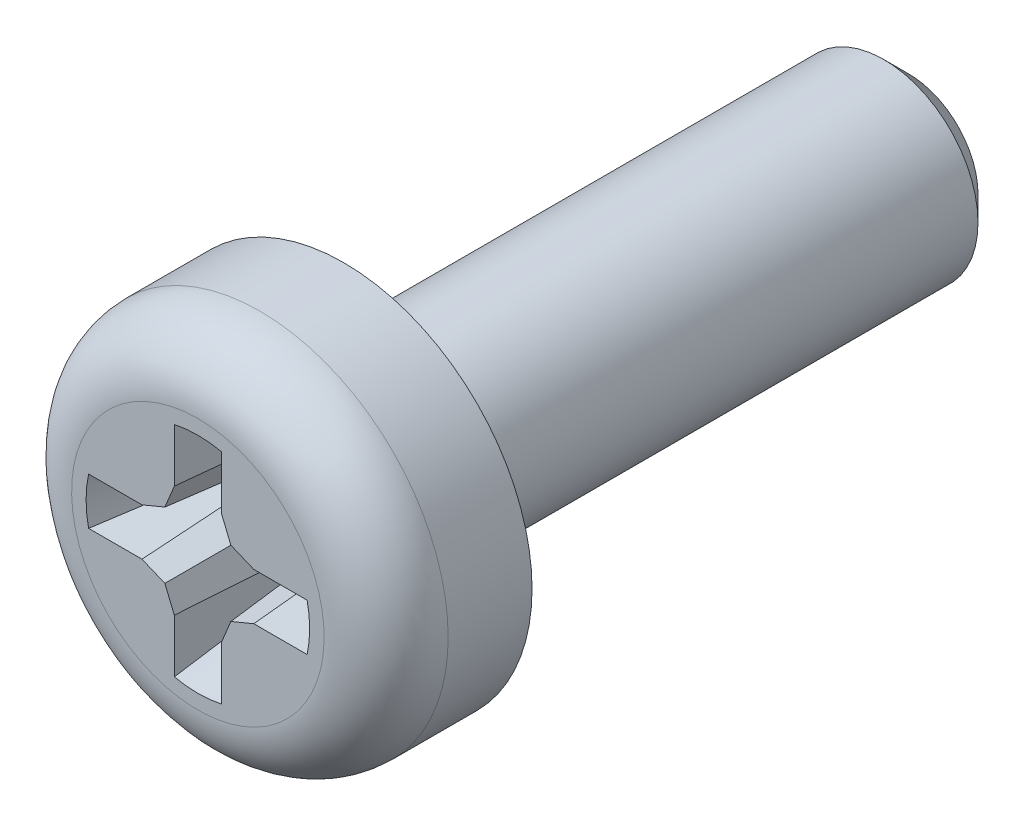
ISO-10303-21;
HEADER;
FILE_DESCRIPTION(('STEP AP214'),'2;1');
FILE_NAME('part.step','',(''),(''),'','','');
FILE_SCHEMA(('AUTOMOTIVE_DESIGN { 1 0 10303 214 1 1 1 1 }'));
ENDSEC;
DATA;
#1=APPLICATION_CONTEXT('core data for automotive mechanical design processes');
#2=APPLICATION_PROTOCOL_DEFINITION('international standard','automotive_design',2000,#1);
#3=PRODUCT_CONTEXT('',#1,'mechanical');
#4=PRODUCT('Part','Part','',(#3));
#5=PRODUCT_RELATED_PRODUCT_CATEGORY('part','',(#4));
#6=PRODUCT_DEFINITION_FORMATION('','',#4);
#7=PRODUCT_DEFINITION_CONTEXT('part definition',#1,'design');
#8=PRODUCT_DEFINITION('design','',#6,#7);
#9=PRODUCT_DEFINITION_SHAPE('','',#8);
#10=(LENGTH_UNIT() NAMED_UNIT(*) SI_UNIT(.MILLI.,.METRE.));
#11=(NAMED_UNIT(*) PLANE_ANGLE_UNIT() SI_UNIT($,.RADIAN.));
#12=(NAMED_UNIT(*) SI_UNIT($,.STERADIAN.) SOLID_ANGLE_UNIT());
#13=UNCERTAINTY_MEASURE_WITH_UNIT(LENGTH_MEASURE(1.E-05),#10,'distance_accuracy_value','');
#14=(GEOMETRIC_REPRESENTATION_CONTEXT(3) GLOBAL_UNCERTAINTY_ASSIGNED_CONTEXT((#13)) GLOBAL_UNIT_ASSIGNED_CONTEXT((#10,
#11,#12)) REPRESENTATION_CONTEXT('',''));
#15=CARTESIAN_POINT('',(0.,0.,0.));
#16=DIRECTION('',(0.,0.,1.));
#17=DIRECTION('',(1.,0.,0.));
#18=AXIS2_PLACEMENT_3D('',#15,#16,#17);
#19=CARTESIAN_POINT('',(0.,0.,0.));
#20=DIRECTION('',(0.,0.,1.));
#21=DIRECTION('',(1.,0.,0.));
#22=AXIS2_PLACEMENT_3D('',#19,#20,#21);
#23=PLANE('',#22);
#24=CARTESIAN_POINT('',(0.,0.,0.));
#25=DIRECTION('',(0.,0.,1.));
#26=DIRECTION('',(1.,0.,0.));
#27=AXIS2_PLACEMENT_3D('',#24,#25,#26);
#28=CIRCLE('',#27,4.);
#29=CARTESIAN_POINT('',(-4.,0.,0.));
#30=VERTEX_POINT('',#29);
#31=EDGE_CURVE('E56',#30,#30,#28,.T.);
#32=ORIENTED_EDGE('',*,*,#31,.F.);
#33=EDGE_LOOP('',(#32));
#34=FACE_BOUND('',#33,.T.);
#35=CARTESIAN_POINT('',(0.,0.,0.));
#36=DIRECTION('',(0.,0.,1.));
#37=DIRECTION('',(1.,0.,0.));
#38=AXIS2_PLACEMENT_3D('',#35,#36,#37);
#39=CIRCLE('',#38,2.);
#40=CARTESIAN_POINT('',(2.,0.,0.));
#41=VERTEX_POINT('',#40);
#42=EDGE_CURVE('E11',#41,#41,#39,.F.);
#43=ORIENTED_EDGE('',*,*,#42,.F.);
#44=EDGE_LOOP('',(#43));
#45=FACE_BOUND('',#44,.T.);
#46=ADVANCED_FACE('F39',(#34,#45),#23,.F.);
#47=CARTESIAN_POINT('',(0.,0.,3.1));
#48=DIRECTION('',(0.,0.,-1.));
#49=DIRECTION('',(-1.,0.,0.));
#50=AXIS2_PLACEMENT_3D('',#47,#48,#49);
#51=CYLINDRICAL_SURFACE('',#50,4.);
#52=CARTESIAN_POINT('',(0.,0.,1.7825));
#53=DIRECTION('',(0.,0.,-1.));
#54=DIRECTION('',(0.,1.,0.));
#55=AXIS2_PLACEMENT_3D('',#52,#53,#54);
#56=CIRCLE('',#55,4.);
#57=CARTESIAN_POINT('',(-4.,0.,1.7825));
#58=VERTEX_POINT('',#57);
#59=EDGE_CURVE('E456',#58,#58,#56,.T.);
#60=CARTESIAN_POINT('',(-4.,0.,1.7825));
#61=CARTESIAN_POINT('',(-4.,0.,1.76393229166667));
#62=CARTESIAN_POINT('',(-4.,0.,1.74536458333333));
#63=CARTESIAN_POINT('',(-4.,0.,1.70822916666667));
#64=CARTESIAN_POINT('',(-4.,0.,1.68966145833333));
#65=CARTESIAN_POINT('',(-4.,0.,1.65252604166667));
#66=CARTESIAN_POINT('',(-4.,0.,1.63395833333333));
#67=CARTESIAN_POINT('',(-4.,0.,1.59682291666667));
#68=CARTESIAN_POINT('',(-4.,0.,1.57825520833333));
#69=CARTESIAN_POINT('',(-4.,0.,1.54111979166667));
#70=CARTESIAN_POINT('',(-4.,0.,1.52255208333333));
#71=CARTESIAN_POINT('',(-4.,0.,1.48541666666667));
#72=CARTESIAN_POINT('',(-4.,0.,1.46684895833333));
#73=CARTESIAN_POINT('',(-4.,0.,1.42971354166667));
#74=CARTESIAN_POINT('',(-4.,0.,1.41114583333333));
#75=CARTESIAN_POINT('',(-4.,0.,1.37401041666667));
#76=CARTESIAN_POINT('',(-4.,0.,1.35544270833333));
#77=CARTESIAN_POINT('',(-4.,0.,1.31830729166667));
#78=CARTESIAN_POINT('',(-4.,0.,1.29973958333333));
#79=CARTESIAN_POINT('',(-4.,0.,1.26260416666667));
#80=CARTESIAN_POINT('',(-4.,0.,1.24403645833333));
#81=CARTESIAN_POINT('',(-4.,0.,1.20690104166667));
#82=CARTESIAN_POINT('',(-4.,0.,1.18833333333333));
#83=CARTESIAN_POINT('',(-4.,0.,1.15119791666667));
#84=CARTESIAN_POINT('',(-4.,0.,1.13263020833333));
#85=CARTESIAN_POINT('',(-4.,0.,1.09549479166667));
#86=CARTESIAN_POINT('',(-4.,0.,1.07692708333333));
#87=CARTESIAN_POINT('',(-4.,0.,1.03979166666667));
#88=CARTESIAN_POINT('',(-4.,0.,1.02122395833333));
#89=CARTESIAN_POINT('',(-4.,0.,0.984088541666667));
#90=CARTESIAN_POINT('',(-4.,0.,0.965520833333333));
#91=CARTESIAN_POINT('',(-4.,0.,0.928385416666666));
#92=CARTESIAN_POINT('',(-4.,0.,0.909817708333333));
#93=CARTESIAN_POINT('',(-4.,0.,0.872682291666666));
#94=CARTESIAN_POINT('',(-4.,0.,0.854114583333333));
#95=CARTESIAN_POINT('',(-4.,0.,0.816979166666667));
#96=CARTESIAN_POINT('',(-4.,0.,0.798411458333333));
#97=CARTESIAN_POINT('',(-4.,0.,0.761276041666667));
#98=CARTESIAN_POINT('',(-4.,0.,0.742708333333333));
#99=CARTESIAN_POINT('',(-4.,0.,0.705572916666667));
#100=CARTESIAN_POINT('',(-4.,0.,0.687005208333333));
#101=CARTESIAN_POINT('',(-4.,0.,0.649869791666667));
#102=CARTESIAN_POINT('',(-4.,0.,0.631302083333333));
#103=CARTESIAN_POINT('',(-4.,0.,0.594166666666667));
#104=CARTESIAN_POINT('',(-4.,0.,0.575598958333333));
#105=CARTESIAN_POINT('',(-4.,0.,0.538463541666667));
#106=CARTESIAN_POINT('',(-4.,0.,0.519895833333333));
#107=CARTESIAN_POINT('',(-4.,0.,0.482760416666667));
#108=CARTESIAN_POINT('',(-4.,0.,0.464192708333333));
#109=CARTESIAN_POINT('',(-4.,0.,0.427057291666667));
#110=CARTESIAN_POINT('',(-4.,0.,0.408489583333333));
#111=CARTESIAN_POINT('',(-4.,0.,0.371354166666667));
#112=CARTESIAN_POINT('',(-4.,0.,0.352786458333333));
#113=CARTESIAN_POINT('',(-4.,0.,0.315651041666667));
#114=CARTESIAN_POINT('',(-4.,0.,0.297083333333333));
#115=CARTESIAN_POINT('',(-4.,0.,0.259947916666666));
#116=CARTESIAN_POINT('',(-4.,0.,0.241380208333333));
#117=CARTESIAN_POINT('',(-4.,0.,0.204244791666667));
#118=CARTESIAN_POINT('',(-4.,0.,0.185677083333333));
#119=CARTESIAN_POINT('',(-4.,0.,0.148541666666667));
#120=CARTESIAN_POINT('',(-4.,0.,0.129973958333333));
#121=CARTESIAN_POINT('',(-4.,0.,0.0928385416666666));
#122=CARTESIAN_POINT('',(-4.,0.,0.0742708333333332));
#123=CARTESIAN_POINT('',(-4.,0.,0.0371354166666665));
#124=CARTESIAN_POINT('',(-4.,0.,0.0185677083333332));
#125=CARTESIAN_POINT('',(-4.,0.,0.));
#126=B_SPLINE_CURVE_WITH_KNOTS('',3,(#60,#61,#62,#63,#64,#65,#66,#67,#68,#69,#70,#71,#72,#73,
#74,#75,#76,#77,#78,#79,#80,#81,#82,#83,#84,#85,#86,#87,#88,#89,#90,#91,#92,#93,#94,#95,#96,#97,
#98,#99,#100,#101,#102,#103,#104,#105,#106,#107,#108,#109,#110,#111,#112,#113,#114,#115,#116,
#117,#118,#119,#120,#121,#122,#123,#124,#125),.UNSPECIFIED.,.F.,.F.,(4,2,2,2,2,2,2,2,2,2,2,2,2,
2,2,2,2,2,2,2,2,2,2,2,2,2,2,2,2,2,2,2,4),(0.,0.055703125,0.11140625,0.167109375,0.2228125,
0.278515625,0.33421875,0.389921875,0.445625,0.501328125,0.55703125,0.612734375,0.6684375,
0.724140625,0.77984375,0.835546875,0.89125,0.946953125,1.00265625,1.058359375,1.1140625,
1.169765625,1.22546875,1.281171875,1.336875,1.392578125,1.44828125,1.503984375,1.5596875,
1.615390625,1.67109375,1.726796875,1.7825),.UNSPECIFIED.);
#127=EDGE_CURVE('BSEAM382',#58,#30,#126,.T.);
#128=ORIENTED_EDGE('',*,*,#59,.T.);
#129=ORIENTED_EDGE('',*,*,#31,.T.);
#130=ORIENTED_EDGE('',*,*,#127,.T.);
#131=ORIENTED_EDGE('',*,*,#127,.F.);
#132=EDGE_LOOP('',(#128,#130,#129,#131));
#133=FACE_BOUND('',#132,.T.);
#134=ADVANCED_FACE('F382',(#133),#51,.T.);
#135=CARTESIAN_POINT('',(0.,0.,1.7825));
#136=DIRECTION('',(0.,0.,-1.));
#137=DIRECTION('',(0.,1.,0.));
#138=AXIS2_PLACEMENT_3D('',#135,#136,#137);
#139=TOROIDAL_SURFACE('',#138,2.6825,1.3175);
#140=ORIENTED_EDGE('',*,*,#59,.F.);
#141=EDGE_LOOP('',(#140));
#142=FACE_BOUND('',#141,.T.);
#143=CARTESIAN_POINT('',(0.,0.,3.1));
#144=DIRECTION('',(0.,0.,-1.));
#145=DIRECTION('',(0.,1.,0.));
#146=AXIS2_PLACEMENT_3D('',#143,#144,#145);
#147=CIRCLE('',#146,2.6825);
#148=CARTESIAN_POINT('',(0.,2.6825,3.1));
#149=VERTEX_POINT('',#148);
#150=EDGE_CURVE('E452',#149,#149,#147,.T.);
#151=ORIENTED_EDGE('',*,*,#150,.T.);
#152=EDGE_LOOP('',(#151));
#153=FACE_BOUND('',#152,.T.);
#154=ADVANCED_FACE('F388',(#142,#153),#139,.T.);
#155=CARTESIAN_POINT('',(0.,0.,3.1));
#156=DIRECTION('',(0.,0.,1.));
#157=DIRECTION('',(1.,0.,0.));
#158=AXIS2_PLACEMENT_3D('',#155,#156,#157);
#159=PLANE('',#158);
#160=DIRECTION('',(0.,-1.,0.));
#161=VECTOR('',#160,1.);
#162=CARTESIAN_POINT('',(-0.500000000000005,1.1875,3.1));
#163=LINE('',#162,#161);
#164=CARTESIAN_POINT('',(-0.500000000000009,2.32177195262584,3.1));
#165=VERTEX_POINT('',#164);
#166=CARTESIAN_POINT('',(-0.500000000000005,1.1875,3.1));
#167=VERTEX_POINT('',#166);
#168=EDGE_CURVE('E337',#165,#167,#163,.T.);
#169=ORIENTED_EDGE('',*,*,#168,.F.);
#170=CARTESIAN_POINT('',(0.,0.,3.1));
#171=DIRECTION('',(0.,0.,1.));
#172=DIRECTION('',(1.,0.,0.));
#173=AXIS2_PLACEMENT_3D('',#170,#171,#172);
#174=CIRCLE('',#173,2.375);
#175=CARTESIAN_POINT('',(0.5,2.32177195262584,3.1));
#176=VERTEX_POINT('',#175);
#177=EDGE_CURVE('E344',#176,#165,#174,.T.);
#178=ORIENTED_EDGE('',*,*,#177,.F.);
#179=DIRECTION('',(0.,1.,0.));
#180=VECTOR('',#179,1.);
#181=CARTESIAN_POINT('',(0.5,2.32177195262584,3.1));
#182=LINE('',#181,#180);
#183=CARTESIAN_POINT('',(0.5,1.1875,3.1));
#184=VERTEX_POINT('',#183);
#185=EDGE_CURVE('E440',#184,#176,#182,.T.);
#186=ORIENTED_EDGE('',*,*,#185,.F.);
#187=DIRECTION('',(-0.382683432365083,0.923879532511289,0.));
#188=VECTOR('',#187,1.);
#189=CARTESIAN_POINT('',(0.5,1.1875,3.1));
#190=LINE('',#189,#188);
#191=CARTESIAN_POINT('',(0.701364087934246,0.701364087934246,3.1));
#192=VERTEX_POINT('',#191);
#193=EDGE_CURVE('E434',#192,#184,#190,.T.);
#194=ORIENTED_EDGE('',*,*,#193,.F.);
#195=DIRECTION('',(-0.92387953251129,0.382683432365083,0.));
#196=VECTOR('',#195,1.);
#197=CARTESIAN_POINT('',(1.1875,0.500000000000001,3.1));
#198=LINE('',#197,#196);
#199=CARTESIAN_POINT('',(1.1875,0.500000000000001,3.1));
#200=VERTEX_POINT('',#199);
#201=EDGE_CURVE('E193',#200,#192,#198,.T.);
#202=ORIENTED_EDGE('',*,*,#201,.F.);
#203=DIRECTION('',(-1.,0.,0.));
#204=VECTOR('',#203,1.);
#205=CARTESIAN_POINT('',(1.1875,0.500000000000001,3.1));
#206=LINE('',#205,#204);
#207=CARTESIAN_POINT('',(2.32177195262584,0.500000000000001,3.1));
#208=VERTEX_POINT('',#207);
#209=EDGE_CURVE('E426',#208,#200,#206,.T.);
#210=ORIENTED_EDGE('',*,*,#209,.F.);
#211=CARTESIAN_POINT('',(0.,0.,3.1));
#212=DIRECTION('',(0.,0.,1.));
#213=DIRECTION('',(1.,0.,0.));
#214=AXIS2_PLACEMENT_3D('',#211,#212,#213);
#215=CIRCLE('',#214,2.375);
#216=CARTESIAN_POINT('',(2.32177195262584,-0.499999999999976,3.1));
#217=VERTEX_POINT('',#216);
#218=EDGE_CURVE('E290',#217,#208,#215,.T.);
#219=ORIENTED_EDGE('',*,*,#218,.F.);
#220=DIRECTION('',(1.,0.,0.));
#221=VECTOR('',#220,1.);
#222=CARTESIAN_POINT('',(2.32177195262584,-0.499999999999976,3.1));
#223=LINE('',#222,#221);
#224=CARTESIAN_POINT('',(1.1875,-0.499999999999988,3.1));
#225=VERTEX_POINT('',#224);
#226=EDGE_CURVE('E519',#225,#217,#223,.T.);
#227=ORIENTED_EDGE('',*,*,#226,.F.);
#228=DIRECTION('',(0.923879532511285,0.382683432365093,0.));
#229=VECTOR('',#228,1.);
#230=CARTESIAN_POINT('',(1.1875,-0.499999999999988,3.1));
#231=LINE('',#230,#229);
#232=CARTESIAN_POINT('',(0.701364087934254,-0.701364087934238,3.1));
#233=VERTEX_POINT('',#232);
#234=EDGE_CURVE('E522',#233,#225,#231,.T.);
#235=ORIENTED_EDGE('',*,*,#234,.F.);
#236=DIRECTION('',(0.382683432365073,0.923879532511294,0.));
#237=VECTOR('',#236,1.);
#238=CARTESIAN_POINT('',(0.500000000000013,-1.18749999999999,3.1));
#239=LINE('',#238,#237);
#240=CARTESIAN_POINT('',(0.500000000000013,-1.18749999999999,3.1));
#241=VERTEX_POINT('',#240);
#242=EDGE_CURVE('E525',#241,#233,#239,.T.);
#243=ORIENTED_EDGE('',*,*,#242,.F.);
#244=DIRECTION('',(0.,1.,0.));
#245=VECTOR('',#244,1.);
#246=CARTESIAN_POINT('',(0.500000000000013,-1.18749999999999,3.1));
#247=LINE('',#246,#245);
#248=CARTESIAN_POINT('',(0.500000000000025,-2.32177195262583,3.1));
#249=VERTEX_POINT('',#248);
#250=EDGE_CURVE('E528',#249,#241,#247,.T.);
#251=ORIENTED_EDGE('',*,*,#250,.F.);
#252=CARTESIAN_POINT('',(0.,0.,3.1));
#253=DIRECTION('',(0.,0.,1.));
#254=DIRECTION('',(-1.,0.,0.));
#255=AXIS2_PLACEMENT_3D('',#252,#253,#254);
#256=CIRCLE('',#255,2.375);
#257=CARTESIAN_POINT('',(-0.499999999999984,-2.32177195262584,3.1));
#258=VERTEX_POINT('',#257);
#259=EDGE_CURVE('E499',#258,#249,#256,.T.);
#260=ORIENTED_EDGE('',*,*,#259,.F.);
#261=DIRECTION('',(0.,-1.,0.));
#262=VECTOR('',#261,1.);
#263=CARTESIAN_POINT('',(-0.499999999999984,-2.32177195262584,3.1));
#264=LINE('',#263,#262);
#265=CARTESIAN_POINT('',(-0.499999999999992,-1.1875,3.1));
#266=VERTEX_POINT('',#265);
#267=EDGE_CURVE('E503',#266,#258,#264,.T.);
#268=ORIENTED_EDGE('',*,*,#267,.F.);
#269=DIRECTION('',(0.382683432365089,-0.923879532511287,0.));
#270=VECTOR('',#269,1.);
#271=CARTESIAN_POINT('',(-0.499999999999992,-1.1875,3.1));
#272=LINE('',#271,#270);
#273=CARTESIAN_POINT('',(-0.701364087934241,-0.701364087934251,3.1));
#274=VERTEX_POINT('',#273);
#275=EDGE_CURVE('E507',#274,#266,#272,.T.);
#276=ORIENTED_EDGE('',*,*,#275,.F.);
#277=DIRECTION('',(0.923879532511292,-0.382683432365076,0.));
#278=VECTOR('',#277,1.);
#279=CARTESIAN_POINT('',(-1.1875,-0.500000000000009,3.1));
#280=LINE('',#279,#278);
#281=CARTESIAN_POINT('',(-1.1875,-0.500000000000009,3.1));
#282=VERTEX_POINT('',#281);
#283=EDGE_CURVE('E511',#282,#274,#280,.T.);
#284=ORIENTED_EDGE('',*,*,#283,.F.);
#285=DIRECTION('',(1.,0.,0.));
#286=VECTOR('',#285,1.);
#287=CARTESIAN_POINT('',(-1.1875,-0.500000000000009,3.1));
#288=LINE('',#287,#286);
#289=CARTESIAN_POINT('',(-2.32177195262584,-0.500000000000017,3.1));
#290=VERTEX_POINT('',#289);
#291=EDGE_CURVE('E515',#290,#282,#288,.T.);
#292=ORIENTED_EDGE('',*,*,#291,.F.);
#293=CARTESIAN_POINT('',(0.,0.,3.1));
#294=DIRECTION('',(0.,0.,1.));
#295=DIRECTION('',(0.,1.,0.));
#296=AXIS2_PLACEMENT_3D('',#293,#294,#295);
#297=CIRCLE('',#296,2.375);
#298=CARTESIAN_POINT('',(-2.32177195262584,0.499999999999992,3.1));
#299=VERTEX_POINT('',#298);
#300=EDGE_CURVE('E138',#299,#290,#297,.T.);
#301=ORIENTED_EDGE('',*,*,#300,.F.);
#302=DIRECTION('',(-1.,0.,0.));
#303=VECTOR('',#302,1.);
#304=CARTESIAN_POINT('',(-2.32177195262584,0.499999999999992,3.1));
#305=LINE('',#304,#303);
#306=CARTESIAN_POINT('',(-1.1875,0.499999999999996,3.1));
#307=VERTEX_POINT('',#306);
#308=EDGE_CURVE('E484',#307,#299,#305,.T.);
#309=ORIENTED_EDGE('',*,*,#308,.F.);
#310=DIRECTION('',(-0.923879532511288,-0.382683432365086,0.));
#311=VECTOR('',#310,1.);
#312=CARTESIAN_POINT('',(-1.1875,0.499999999999996,3.1));
#313=LINE('',#312,#311);
#314=CARTESIAN_POINT('',(-0.701364087934249,0.701364087934243,3.1));
#315=VERTEX_POINT('',#314);
#316=EDGE_CURVE('E487',#315,#307,#313,.T.);
#317=ORIENTED_EDGE('',*,*,#316,.F.);
#318=DIRECTION('',(-0.38268343236508,-0.923879532511291,0.));
#319=VECTOR('',#318,1.);
#320=CARTESIAN_POINT('',(-0.500000000000005,1.1875,3.1));
#321=LINE('',#320,#319);
#322=EDGE_CURVE('E493',#167,#315,#321,.T.);
#323=ORIENTED_EDGE('',*,*,#322,.F.);
#324=EDGE_LOOP('',(#169,#178,#186,#194,#202,#210,#219,#227,#235,#243,#251,#260,#268,#276,#284,
#292,#301,#309,#317,#323));
#325=FACE_BOUND('',#324,.T.);
#326=ORIENTED_EDGE('',*,*,#150,.F.);
#327=EDGE_LOOP('',(#326));
#328=FACE_BOUND('',#327,.T.);
#329=ADVANCED_FACE('F393',(#325,#328),#159,.T.);
#330=CARTESIAN_POINT('',(0.,0.,-12.));
#331=DIRECTION('',(0.,0.,1.));
#332=DIRECTION('',(1.,0.,0.));
#333=AXIS2_PLACEMENT_3D('',#330,#331,#332);
#334=PLANE('',#333);
#335=CARTESIAN_POINT('',(0.,0.,-12.));
#336=DIRECTION('',(0.,0.,1.));
#337=DIRECTION('',(1.,0.,0.));
#338=AXIS2_PLACEMENT_3D('',#335,#336,#337);
#339=CIRCLE('',#338,1.475);
#340=CARTESIAN_POINT('',(1.475,0.,-12.));
#341=VERTEX_POINT('',#340);
#342=EDGE_CURVE('E448',#341,#341,#339,.F.);
#343=ORIENTED_EDGE('',*,*,#342,.T.);
#344=EDGE_LOOP('',(#343));
#345=FACE_BOUND('',#344,.T.);
#346=ADVANCED_FACE('F396',(#345),#334,.F.);
#347=CARTESIAN_POINT('',(0.,0.,0.));
#348=DIRECTION('',(0.,0.,1.));
#349=DIRECTION('',(1.,0.,0.));
#350=AXIS2_PLACEMENT_3D('',#347,#348,#349);
#351=CYLINDRICAL_SURFACE('',#350,2.);
#352=CARTESIAN_POINT('',(0.,0.,-11.475));
#353=DIRECTION('',(0.,0.,1.));
#354=DIRECTION('',(1.,0.,0.));
#355=AXIS2_PLACEMENT_3D('',#352,#353,#354);
#356=CIRCLE('',#355,2.);
#357=CARTESIAN_POINT('',(2.,0.,-11.475));
#358=VERTEX_POINT('',#357);
#359=EDGE_CURVE('E229',#358,#358,#356,.T.);
#360=ORIENTED_EDGE('',*,*,#359,.T.);
#361=EDGE_LOOP('',(#360));
#362=FACE_BOUND('',#361,.T.);
#363=ORIENTED_EDGE('',*,*,#42,.T.);
#364=EDGE_LOOP('',(#363));
#365=FACE_BOUND('',#364,.T.);
#366=ADVANCED_FACE('F403',(#362,#365),#351,.T.);
#367=CARTESIAN_POINT('',(0.,0.,-11.475));
#368=DIRECTION('',(0.,0.,1.));
#369=DIRECTION('',(1.,0.,0.));
#370=AXIS2_PLACEMENT_3D('',#367,#368,#369);
#371=CONICAL_SURFACE('',#370,2.,0.78539816339745);
#372=ORIENTED_EDGE('',*,*,#342,.F.);
#373=EDGE_LOOP('',(#372));
#374=FACE_BOUND('',#373,.T.);
#375=ORIENTED_EDGE('',*,*,#359,.F.);
#376=EDGE_LOOP('',(#375));
#377=FACE_BOUND('',#376,.T.);
#378=ADVANCED_FACE('F238',(#374,#377),#371,.T.);
#379=CARTESIAN_POINT('',(0.,0.,3.1));
#380=DIRECTION('',(0.,0.,1.));
#381=DIRECTION('',(1.,0.,0.));
#382=AXIS2_PLACEMENT_3D('',#379,#380,#381);
#383=CONICAL_SURFACE('',#382,2.375,0.26179938779915);
#384=ORIENTED_EDGE('',*,*,#177,.T.);
#385=CARTESIAN_POINT('',(-0.500000000000009,2.32177195262584,3.1));
#386=CARTESIAN_POINT('',(-0.47343930678139,2.24427703480566,2.79640988731358));
#387=CARTESIAN_POINT('',(-0.446879730252152,2.16673165946756,2.49283253844521));
#388=CARTESIAN_POINT('',(-0.393764081079549,2.01148388565445,1.88571789030724));
#389=CARTESIAN_POINT('',(-0.367208008434063,1.93378148727489,1.58218059101342));
#390=CARTESIAN_POINT('',(-0.314100594056121,1.77816343242277,0.975160067009124));
#391=CARTESIAN_POINT('',(-0.287549252325663,1.70024777586032,0.671676842321505));
#392=CARTESIAN_POINT('',(-0.234454103493325,1.54407853183752,0.0647965141449838));
#393=CARTESIAN_POINT('',(-0.207910296396182,1.46582494416517,-0.238600589289766));
#394=CARTESIAN_POINT('',(-0.181371669535779,1.38734008699268,-0.541938482347625));
#395=B_SPLINE_CURVE_WITH_KNOTS('',3,(#385,#386,#387,#388,#389,#390,#391,#392,#393,#394),
.UNSPECIFIED.,.F.,.F.,(4,2,2,2,4),(0.,0.943345660311494,1.88669074731104,2.83003623194303,
3.77338230842007),.UNSPECIFIED.);
#396=CARTESIAN_POINT('',(-0.269467371609197,1.64705627783094,0.465));
#397=VERTEX_POINT('',#396);
#398=EDGE_CURVE('E247',#397,#165,#395,.F.);
#399=ORIENTED_EDGE('',*,*,#398,.F.);
#400=CARTESIAN_POINT('',(0.,0.,0.465));
#401=DIRECTION('',(0.,0.,1.));
#402=DIRECTION('',(1.,0.,0.));
#403=AXIS2_PLACEMENT_3D('',#400,#401,#402);
#404=CIRCLE('',#403,1.66895387794399);
#405=CARTESIAN_POINT('',(0.26946737160919,1.64705627783094,0.465));
#406=VERTEX_POINT('',#405);
#407=EDGE_CURVE('E220',#406,#397,#404,.T.);
#408=ORIENTED_EDGE('',*,*,#407,.F.);
#409=CARTESIAN_POINT('',(0.26946737160919,1.64705627783094,0.465));
#410=CARTESIAN_POINT('',(0.28867325225766,1.70351500535314,0.684524220332607));
#411=CARTESIAN_POINT('',(0.307880871567887,1.75989578614274,0.904068313660021));
#412=CARTESIAN_POINT('',(0.346298880089182,1.8725328045999,1.34318816042636));
#413=CARTESIAN_POINT('',(0.3655092692997,1.9287890422922,1.56276391385898));
#414=CARTESIAN_POINT('',(0.403932116044099,2.04120834207889,2.00193906176845));
#415=CARTESIAN_POINT('',(0.423144573577789,2.09737140418194,2.2215384562431));
#416=CARTESIAN_POINT('',(0.461571147425222,2.20962295987111,2.66075620513519));
#417=CARTESIAN_POINT('',(0.480785263739293,2.26571145344256,2.88037455955635));
#418=CARTESIAN_POINT('',(0.5,2.32177195262584,3.1));
#419=B_SPLINE_CURVE_WITH_KNOTS('',3,(#409,#410,#411,#412,#413,#414,#415,#416,#417,#418),
.UNSPECIFIED.,.F.,.F.,(4,2,2,2,4),(0.,0.682441186737258,1.36488223792859,2.04732322572323,
2.72976434777311),.UNSPECIFIED.);
#420=EDGE_CURVE('E65',#406,#176,#419,.T.);
#421=ORIENTED_EDGE('',*,*,#420,.T.);
#422=EDGE_LOOP('',(#384,#399,#408,#421));
#423=FACE_BOUND('',#422,.T.);
#424=ADVANCED_FACE('F235',(#423),#383,.F.);
#425=CARTESIAN_POINT('',(0.5,2.32177195262584,3.1));
#426=DIRECTION('',(-0.996194698091746,0.,0.0871557427476584));
#427=DIRECTION('',(0.0871557427476584,0.,0.996194698091746));
#428=AXIS2_PLACEMENT_3D('',#425,#426,#427);
#429=PLANE('',#428);
#430=ORIENTED_EDGE('',*,*,#185,.T.);
#431=ORIENTED_EDGE('',*,*,#420,.F.);
#432=DIRECTION('',(0.,-1.,0.));
#433=VECTOR('',#432,1.);
#434=CARTESIAN_POINT('',(0.26946737160919,0.,0.465));
#435=LINE('',#434,#433);
#436=CARTESIAN_POINT('',(0.26946737160919,1.14164420912853,0.465));
#437=VERTEX_POINT('',#436);
#438=EDGE_CURVE('E207',#437,#406,#435,.F.);
#439=ORIENTED_EDGE('',*,*,#438,.F.);
#440=DIRECTION('',(0.0871426484044397,0.01733375049386,0.996045029063886));
#441=VECTOR('',#440,1.);
#442=CARTESIAN_POINT('',(0.501713327907611,1.1878408021102,3.11958342759577));
#443=LINE('',#442,#441);
#444=EDGE_CURVE('E198',#437,#184,#443,.T.);
#445=ORIENTED_EDGE('',*,*,#444,.T.);
#446=EDGE_LOOP('',(#430,#431,#439,#445));
#447=FACE_BOUND('',#446,.T.);
#448=ADVANCED_FACE('F231',(#447),#429,.T.);
#449=CARTESIAN_POINT('',(0.5,1.1875,3.1));
#450=DIRECTION('',(-0.920363891963227,-0.381227206369647,0.0871557427476584));
#451=DIRECTION('',(0.382683432365083,-0.92387953251129,0.));
#452=AXIS2_PLACEMENT_3D('',#449,#450,#451);
#453=PLANE('',#452);
#454=ORIENTED_EDGE('',*,*,#193,.T.);
#455=ORIENTED_EDGE('',*,*,#444,.F.);
#456=DIRECTION('',(0.382683432365083,-0.92387953251129,0.));
#457=VECTOR('',#456,1.);
#458=CARTESIAN_POINT('',(0.633636969679846,0.262461026462376,0.465));
#459=LINE('',#458,#457);
#460=CARTESIAN_POINT('',(0.524922052924763,0.524922052924764,0.465));
#461=VERTEX_POINT('',#460);
#462=EDGE_CURVE('E202',#461,#437,#459,.F.);
#463=ORIENTED_EDGE('',*,*,#462,.F.);
#464=DIRECTION('',(0.0666626913468326,0.0666626913468325,0.995546167269401));
#465=VECTOR('',#464,1.);
#466=CARTESIAN_POINT('',(0.702629589549231,0.702629589549231,3.11889910618695));
#467=LINE('',#466,#465);
#468=EDGE_CURVE('E186',#461,#192,#467,.T.);
#469=ORIENTED_EDGE('',*,*,#468,.T.);
#470=EDGE_LOOP('',(#454,#455,#463,#469));
#471=FACE_BOUND('',#470,.T.);
#472=ADVANCED_FACE('F203',(#471),#453,.T.);
#473=CARTESIAN_POINT('',(1.1875,0.500000000000001,3.1));
#474=DIRECTION('',(-0.381227206369647,-0.920363891963227,0.0871557427476584));
#475=DIRECTION('',(0.92387953251129,-0.382683432365083,0.));
#476=AXIS2_PLACEMENT_3D('',#473,#474,#475);
#477=PLANE('',#476);
#478=ORIENTED_EDGE('',*,*,#201,.T.);
#479=ORIENTED_EDGE('',*,*,#468,.F.);
#480=DIRECTION('',(0.92387953251129,-0.382683432365083,0.));
#481=VECTOR('',#480,1.);
#482=CARTESIAN_POINT('',(0.262461026462376,0.633636969679846,0.465));
#483=LINE('',#482,#481);
#484=CARTESIAN_POINT('',(1.14164420912853,0.269467371609191,0.465));
#485=VERTEX_POINT('',#484);
#486=EDGE_CURVE('E190',#485,#461,#483,.F.);
#487=ORIENTED_EDGE('',*,*,#486,.F.);
#488=DIRECTION('',(0.0173337504938599,0.0871426484044397,0.996045029063886));
#489=VECTOR('',#488,1.);
#490=CARTESIAN_POINT('',(1.1875,0.500000000000001,3.1));
#491=LINE('',#490,#489);
#492=EDGE_CURVE('E199',#485,#200,#491,.T.);
#493=ORIENTED_EDGE('',*,*,#492,.T.);
#494=EDGE_LOOP('',(#478,#479,#487,#493));
#495=FACE_BOUND('',#494,.T.);
#496=ADVANCED_FACE('F188',(#495),#477,.T.);
#497=CARTESIAN_POINT('',(1.1875,0.500000000000001,3.1));
#498=DIRECTION('',(0.,-0.996194698091746,0.0871557427476584));
#499=DIRECTION('',(0.,-0.0871557427476584,-0.996194698091746));
#500=AXIS2_PLACEMENT_3D('',#497,#498,#499);
#501=PLANE('',#500);
#502=ORIENTED_EDGE('',*,*,#209,.T.);
#503=ORIENTED_EDGE('',*,*,#492,.F.);
#504=DIRECTION('',(1.,0.,0.));
#505=VECTOR('',#504,1.);
#506=CARTESIAN_POINT('',(0.,0.269467371609191,0.465));
#507=LINE('',#506,#505);
#508=CARTESIAN_POINT('',(1.64705627783094,0.269467371609191,0.465));
#509=VERTEX_POINT('',#508);
#510=EDGE_CURVE('E211',#509,#485,#507,.F.);
#511=ORIENTED_EDGE('',*,*,#510,.F.);
#512=CARTESIAN_POINT('',(2.32177195262584,0.500000000000001,3.1));
#513=CARTESIAN_POINT('',(2.24427703480566,0.473439306781382,2.79640988731358));
#514=CARTESIAN_POINT('',(2.16673165946756,0.446879730252145,2.49283253844521));
#515=CARTESIAN_POINT('',(2.01148388565445,0.393764081079542,1.88571789030724));
#516=CARTESIAN_POINT('',(1.93378148727489,0.367208008434057,1.58218059101342));
#517=CARTESIAN_POINT('',(1.77816343242277,0.314100594056115,0.975160067009124));
#518=CARTESIAN_POINT('',(1.70024777586033,0.287549252325657,0.671676842321504));
#519=CARTESIAN_POINT('',(1.54407853183752,0.234454103493319,0.0647965141449839));
#520=CARTESIAN_POINT('',(1.46582494416517,0.207910296396176,-0.238600589289766));
#521=CARTESIAN_POINT('',(1.38734008699268,0.181371669535775,-0.541938482347625));
#522=B_SPLINE_CURVE_WITH_KNOTS('',3,(#512,#513,#514,#515,#516,#517,#518,#519,#520,#521),
.UNSPECIFIED.,.F.,.F.,(4,2,2,2,4),(0.,0.943345660311494,1.88669074731104,2.83003623194303,
3.77338230842007),.UNSPECIFIED.);
#523=EDGE_CURVE('E422',#509,#208,#522,.F.);
#524=ORIENTED_EDGE('',*,*,#523,.T.);
#525=EDGE_LOOP('',(#502,#503,#511,#524));
#526=FACE_BOUND('',#525,.T.);
#527=ADVANCED_FACE('F243',(#526),#501,.T.);
#528=CARTESIAN_POINT('',(0.,0.,3.1));
#529=DIRECTION('',(0.,0.,1.));
#530=DIRECTION('',(1.,0.,0.));
#531=AXIS2_PLACEMENT_3D('',#528,#529,#530);
#532=CONICAL_SURFACE('',#531,2.375,0.26179938779915);
#533=ORIENTED_EDGE('',*,*,#218,.T.);
#534=ORIENTED_EDGE('',*,*,#523,.F.);
#535=CARTESIAN_POINT('',(0.,0.,0.465));
#536=DIRECTION('',(0.,0.,1.));
#537=DIRECTION('',(1.,0.,0.));
#538=AXIS2_PLACEMENT_3D('',#535,#536,#537);
#539=CIRCLE('',#538,1.66895387794399);
#540=CARTESIAN_POINT('',(1.64705627783094,-0.269467371609173,0.465));
#541=VERTEX_POINT('',#540);
#542=EDGE_CURVE('E129',#541,#509,#539,.T.);
#543=ORIENTED_EDGE('',*,*,#542,.F.);
#544=CARTESIAN_POINT('',(1.64705627783094,-0.269467371609173,0.465));
#545=CARTESIAN_POINT('',(1.70351500535315,-0.288673252257643,0.684524220332607));
#546=CARTESIAN_POINT('',(1.75989578614274,-0.307880871567868,0.904068313660021));
#547=CARTESIAN_POINT('',(1.8725328045999,-0.346298880089162,1.34318816042636));
#548=CARTESIAN_POINT('',(1.9287890422922,-0.36550926929968,1.56276391385898));
#549=CARTESIAN_POINT('',(2.04120834207889,-0.403932116044078,2.00193906176845));
#550=CARTESIAN_POINT('',(2.09737140418194,-0.423144573577767,2.2215384562431));
#551=CARTESIAN_POINT('',(2.20962295987111,-0.461571147425199,2.66075620513519));
#552=CARTESIAN_POINT('',(2.26571145344256,-0.480785263739269,2.88037455955635));
#553=CARTESIAN_POINT('',(2.32177195262584,-0.499999999999976,3.1));
#554=B_SPLINE_CURVE_WITH_KNOTS('',3,(#544,#545,#546,#547,#548,#549,#550,#551,#552,#553),
.UNSPECIFIED.,.F.,.F.,(4,2,2,2,4),(0.,0.682441186737258,1.36488223792859,2.04732322572323,
2.72976434777311),.UNSPECIFIED.);
#555=EDGE_CURVE('E43',#541,#217,#554,.T.);
#556=ORIENTED_EDGE('',*,*,#555,.T.);
#557=EDGE_LOOP('',(#533,#534,#543,#556));
#558=FACE_BOUND('',#557,.T.);
#559=ADVANCED_FACE('F240',(#558),#532,.F.);
#560=CARTESIAN_POINT('',(0.,0.,0.465));
#561=DIRECTION('',(0.,0.,1.));
#562=DIRECTION('',(1.,0.,0.));
#563=AXIS2_PLACEMENT_3D('',#560,#561,#562);
#564=PLANE('',#563);
#565=ORIENTED_EDGE('',*,*,#407,.T.);
#566=DIRECTION('',(0.,1.,0.));
#567=VECTOR('',#566,1.);
#568=CARTESIAN_POINT('',(-0.269467371609191,0.,0.465));
#569=LINE('',#568,#567);
#570=CARTESIAN_POINT('',(-0.269467371609195,1.14164420912853,0.465));
#571=VERTEX_POINT('',#570);
#572=EDGE_CURVE('E261',#397,#571,#569,.F.);
#573=ORIENTED_EDGE('',*,*,#572,.T.);
#574=DIRECTION('',(0.38268343236508,0.923879532511291,0.));
#575=VECTOR('',#574,1.);
#576=CARTESIAN_POINT('',(-0.633636969679847,0.262461026462374,0.465));
#577=LINE('',#576,#575);
#578=CARTESIAN_POINT('',(-0.524922052924765,0.524922052924761,0.465));
#579=VERTEX_POINT('',#578);
#580=EDGE_CURVE('E480',#571,#579,#577,.F.);
#581=ORIENTED_EDGE('',*,*,#580,.T.);
#582=DIRECTION('',(0.923879532511288,0.382683432365086,0.));
#583=VECTOR('',#582,1.);
#584=CARTESIAN_POINT('',(-0.262461026462378,0.633636969679845,0.465));
#585=LINE('',#584,#583);
#586=CARTESIAN_POINT('',(-1.14164420912853,0.269467371609186,0.465));
#587=VERTEX_POINT('',#586);
#588=EDGE_CURVE('E483',#579,#587,#585,.F.);
#589=ORIENTED_EDGE('',*,*,#588,.T.);
#590=DIRECTION('',(1.,0.,0.));
#591=VECTOR('',#590,1.);
#592=CARTESIAN_POINT('',(0.,0.26946737160919,0.465));
#593=LINE('',#592,#591);
#594=CARTESIAN_POINT('',(-1.64705627783094,0.269467371609184,0.465));
#595=VERTEX_POINT('',#594);
#596=EDGE_CURVE('E291',#587,#595,#593,.F.);
#597=ORIENTED_EDGE('',*,*,#596,.T.);
#598=CARTESIAN_POINT('',(0.,0.,0.465));
#599=DIRECTION('',(0.,0.,1.));
#600=DIRECTION('',(1.,0.,0.));
#601=AXIS2_PLACEMENT_3D('',#598,#599,#600);
#602=CIRCLE('',#601,1.66895387794399);
#603=CARTESIAN_POINT('',(-1.64705627783094,-0.269467371609202,0.465));
#604=VERTEX_POINT('',#603);
#605=EDGE_CURVE('E258',#595,#604,#602,.T.);
#606=ORIENTED_EDGE('',*,*,#605,.T.);
#607=DIRECTION('',(-1.,0.,0.));
#608=VECTOR('',#607,1.);
#609=CARTESIAN_POINT('',(0.,-0.269467371609191,0.465));
#610=LINE('',#609,#608);
#611=CARTESIAN_POINT('',(-1.14164420912853,-0.269467371609199,0.465));
#612=VERTEX_POINT('',#611);
#613=EDGE_CURVE('E312',#604,#612,#610,.F.);
#614=ORIENTED_EDGE('',*,*,#613,.T.);
#615=DIRECTION('',(-0.923879532511292,0.382683432365076,0.));
#616=VECTOR('',#615,1.);
#617=CARTESIAN_POINT('',(-0.262461026462372,-0.633636969679848,0.465));
#618=LINE('',#617,#616);
#619=CARTESIAN_POINT('',(-0.52492205292476,-0.524922052924767,0.465));
#620=VERTEX_POINT('',#619);
#621=EDGE_CURVE('E766',#612,#620,#618,.F.);
#622=ORIENTED_EDGE('',*,*,#621,.T.);
#623=DIRECTION('',(-0.38268343236509,0.923879532511287,0.));
#624=VECTOR('',#623,1.);
#625=CARTESIAN_POINT('',(-0.633636969679844,-0.262461026462381,0.465));
#626=LINE('',#625,#624);
#627=CARTESIAN_POINT('',(-0.269467371609182,-1.14164420912853,0.465));
#628=VERTEX_POINT('',#627);
#629=EDGE_CURVE('E557',#620,#628,#626,.F.);
#630=ORIENTED_EDGE('',*,*,#629,.T.);
#631=DIRECTION('',(0.,1.,0.));
#632=VECTOR('',#631,1.);
#633=CARTESIAN_POINT('',(-0.26946737160919,0.,0.465));
#634=LINE('',#633,#632);
#635=CARTESIAN_POINT('',(-0.269467371609179,-1.64705627783094,0.465));
#636=VERTEX_POINT('',#635);
#637=EDGE_CURVE('E338',#628,#636,#634,.F.);
#638=ORIENTED_EDGE('',*,*,#637,.T.);
#639=CARTESIAN_POINT('',(0.,0.,0.465));
#640=DIRECTION('',(0.,0.,1.));
#641=DIRECTION('',(1.,0.,0.));
#642=AXIS2_PLACEMENT_3D('',#639,#640,#641);
#643=CIRCLE('',#642,1.66895387794399);
#644=CARTESIAN_POINT('',(0.269467371609208,-1.64705627783094,0.465));
#645=VERTEX_POINT('',#644);
#646=EDGE_CURVE('E309',#636,#645,#643,.T.);
#647=ORIENTED_EDGE('',*,*,#646,.T.);
#648=DIRECTION('',(0.,-1.,0.));
#649=VECTOR('',#648,1.);
#650=CARTESIAN_POINT('',(0.269467371609191,0.,0.465));
#651=LINE('',#650,#649);
#652=CARTESIAN_POINT('',(0.269467371609203,-1.14164420912853,0.465));
#653=VERTEX_POINT('',#652);
#654=EDGE_CURVE('E365',#645,#653,#651,.F.);
#655=ORIENTED_EDGE('',*,*,#654,.T.);
#656=DIRECTION('',(-0.382683432365073,-0.923879532511294,0.));
#657=VECTOR('',#656,1.);
#658=CARTESIAN_POINT('',(0.633636969679849,-0.26246102646237,0.465));
#659=LINE('',#658,#657);
#660=CARTESIAN_POINT('',(0.524922052924769,-0.524922052924757,0.465));
#661=VERTEX_POINT('',#660);
#662=EDGE_CURVE('E774',#653,#661,#659,.F.);
#663=ORIENTED_EDGE('',*,*,#662,.T.);
#664=DIRECTION('',(-0.923879532511286,-0.382683432365093,0.));
#665=VECTOR('',#664,1.);
#666=CARTESIAN_POINT('',(0.262461026462383,-0.633636969679843,0.465));
#667=LINE('',#666,#665);
#668=CARTESIAN_POINT('',(1.14164420912853,-0.269467371609178,0.465));
#669=VERTEX_POINT('',#668);
#670=EDGE_CURVE('E777',#661,#669,#667,.F.);
#671=ORIENTED_EDGE('',*,*,#670,.T.);
#672=DIRECTION('',(-1.,0.,0.));
#673=VECTOR('',#672,1.);
#674=CARTESIAN_POINT('',(0.,-0.269467371609191,0.465));
#675=LINE('',#674,#673);
#676=EDGE_CURVE('E364',#669,#541,#675,.F.);
#677=ORIENTED_EDGE('',*,*,#676,.T.);
#678=ORIENTED_EDGE('',*,*,#542,.T.);
#679=ORIENTED_EDGE('',*,*,#510,.T.);
#680=ORIENTED_EDGE('',*,*,#486,.T.);
#681=ORIENTED_EDGE('',*,*,#462,.T.);
#682=ORIENTED_EDGE('',*,*,#438,.T.);
#683=EDGE_LOOP('',(#565,#573,#581,#589,#597,#606,#614,#622,#630,#638,#647,#655,#663,#671,#677,
#678,#679,#680,#681,#682));
#684=FACE_BOUND('',#683,.T.);
#685=ADVANCED_FACE('F209',(#684),#564,.T.);
#686=CARTESIAN_POINT('',(0.,0.,3.1));
#687=DIRECTION('',(0.,0.,1.));
#688=DIRECTION('',(0.,1.,0.));
#689=AXIS2_PLACEMENT_3D('',#686,#687,#688);
#690=CONICAL_SURFACE('',#689,2.375,0.26179938779915);
#691=ORIENTED_EDGE('',*,*,#300,.T.);
#692=CARTESIAN_POINT('',(-2.32177195262584,-0.500000000000017,3.1));
#693=CARTESIAN_POINT('',(-2.24427703480566,-0.473439306781397,2.79640988731358));
#694=CARTESIAN_POINT('',(-2.16673165946756,-0.44687973025216,2.49283253844521));
#695=CARTESIAN_POINT('',(-2.01148388565444,-0.393764081079556,1.88571789030724));
#696=CARTESIAN_POINT('',(-1.93378148727489,-0.36720800843407,1.58218059101342));
#697=CARTESIAN_POINT('',(-1.77816343242277,-0.314100594056127,0.975160067009124));
#698=CARTESIAN_POINT('',(-1.70024777586032,-0.287549252325669,0.671676842321504));
#699=CARTESIAN_POINT('',(-1.54407853183752,-0.23445410349333,0.064796514144984));
#700=CARTESIAN_POINT('',(-1.46582494416517,-0.207910296396187,-0.238600589289766));
#701=CARTESIAN_POINT('',(-1.38734008699268,-0.181371669535784,-0.541938482347625));
#702=B_SPLINE_CURVE_WITH_KNOTS('',3,(#692,#693,#694,#695,#696,#697,#698,#699,#700,#701),
.UNSPECIFIED.,.F.,.F.,(4,2,2,2,4),(0.,0.943345660311494,1.88669074731104,2.83003623194303,
3.77338230842007),.UNSPECIFIED.);
#703=EDGE_CURVE('E299',#604,#290,#702,.F.);
#704=ORIENTED_EDGE('',*,*,#703,.F.);
#705=ORIENTED_EDGE('',*,*,#605,.F.);
#706=CARTESIAN_POINT('',(-1.64705627783094,0.269467371609184,0.465));
#707=CARTESIAN_POINT('',(-1.70351500535314,0.288673252257654,0.684524220332607));
#708=CARTESIAN_POINT('',(-1.75989578614274,0.30788087156788,0.904068313660021));
#709=CARTESIAN_POINT('',(-1.8725328045999,0.346298880089175,1.34318816042636));
#710=CARTESIAN_POINT('',(-1.9287890422922,0.365509269299693,1.56276391385898));
#711=CARTESIAN_POINT('',(-2.04120834207889,0.403932116044092,2.00193906176845));
#712=CARTESIAN_POINT('',(-2.09737140418194,0.423144573577781,2.2215384562431));
#713=CARTESIAN_POINT('',(-2.20962295987111,0.461571147425215,2.66075620513519));
#714=CARTESIAN_POINT('',(-2.26571145344256,0.480785263739285,2.88037455955635));
#715=CARTESIAN_POINT('',(-2.32177195262584,0.499999999999992,3.1));
#716=B_SPLINE_CURVE_WITH_KNOTS('',3,(#706,#707,#708,#709,#710,#711,#712,#713,#714,#715),
.UNSPECIFIED.,.F.,.F.,(4,2,2,2,4),(0.,0.682441186737258,1.36488223792859,2.04732322572323,
2.72976434777311),.UNSPECIFIED.);
#717=EDGE_CURVE('E282',#595,#299,#716,.T.);
#718=ORIENTED_EDGE('',*,*,#717,.T.);
#719=EDGE_LOOP('',(#691,#704,#705,#718));
#720=FACE_BOUND('',#719,.T.);
#721=ADVANCED_FACE('F278',(#720),#690,.F.);
#722=CARTESIAN_POINT('',(-2.32177195262584,0.499999999999992,3.1));
#723=DIRECTION('',(0.,-0.996194698091746,0.0871557427476584));
#724=DIRECTION('',(0.,-0.0871557427476584,-0.996194698091746));
#725=AXIS2_PLACEMENT_3D('',#722,#723,#724);
#726=PLANE('',#725);
#727=ORIENTED_EDGE('',*,*,#308,.T.);
#728=ORIENTED_EDGE('',*,*,#717,.F.);
#729=ORIENTED_EDGE('',*,*,#596,.F.);
#730=DIRECTION('',(-0.0173337504938603,0.0871426484044396,0.996045029063886));
#731=VECTOR('',#730,1.);
#732=CARTESIAN_POINT('',(-1.1878408021102,0.501713327907607,3.11958342759577));
#733=LINE('',#732,#731);
#734=EDGE_CURVE('E259',#587,#307,#733,.T.);
#735=ORIENTED_EDGE('',*,*,#734,.T.);
#736=EDGE_LOOP('',(#727,#728,#729,#735));
#737=FACE_BOUND('',#736,.T.);
#738=ADVANCED_FACE('F273',(#737),#726,.T.);
#739=CARTESIAN_POINT('',(-1.1875,0.499999999999996,3.1));
#740=DIRECTION('',(0.38122720636965,-0.920363891963226,0.0871557427476584));
#741=DIRECTION('',(0.923879532511288,0.382683432365086,0.));
#742=AXIS2_PLACEMENT_3D('',#739,#740,#741);
#743=PLANE('',#742);
#744=ORIENTED_EDGE('',*,*,#316,.T.);
#745=ORIENTED_EDGE('',*,*,#734,.F.);
#746=ORIENTED_EDGE('',*,*,#588,.F.);
#747=DIRECTION('',(-0.0666626913468328,0.0666626913468323,0.995546167269401));
#748=VECTOR('',#747,1.);
#749=CARTESIAN_POINT('',(-0.702629589549234,0.702629589549228,3.11889910618695));
#750=LINE('',#749,#748);
#751=EDGE_CURVE('E576',#579,#315,#750,.T.);
#752=ORIENTED_EDGE('',*,*,#751,.T.);
#753=EDGE_LOOP('',(#744,#745,#746,#752));
#754=FACE_BOUND('',#753,.T.);
#755=ADVANCED_FACE('F277',(#754),#743,.T.);
#756=CARTESIAN_POINT('',(-0.500000000000005,1.1875,3.1));
#757=DIRECTION('',(0.920363891963229,-0.381227206369643,0.0871557427476584));
#758=DIRECTION('',(0.38268343236508,0.923879532511291,0.));
#759=AXIS2_PLACEMENT_3D('',#756,#757,#758);
#760=PLANE('',#759);
#761=ORIENTED_EDGE('',*,*,#322,.T.);
#762=ORIENTED_EDGE('',*,*,#751,.F.);
#763=ORIENTED_EDGE('',*,*,#580,.F.);
#764=DIRECTION('',(-0.0871426484044397,0.0173337504938596,0.996045029063886));
#765=VECTOR('',#764,1.);
#766=CARTESIAN_POINT('',(-0.500000000000005,1.1875,3.1));
#767=LINE('',#766,#765);
#768=EDGE_CURVE('E257',#571,#167,#767,.T.);
#769=ORIENTED_EDGE('',*,*,#768,.T.);
#770=EDGE_LOOP('',(#761,#762,#763,#769));
#771=FACE_BOUND('',#770,.T.);
#772=ADVANCED_FACE('F269',(#771),#760,.T.);
#773=CARTESIAN_POINT('',(-0.500000000000005,1.1875,3.1));
#774=DIRECTION('',(0.996194698091746,0.,0.0871557427476584));
#775=DIRECTION('',(0.0871557427476584,0.,-0.996194698091746));
#776=AXIS2_PLACEMENT_3D('',#773,#774,#775);
#777=PLANE('',#776);
#778=ORIENTED_EDGE('',*,*,#168,.T.);
#779=ORIENTED_EDGE('',*,*,#768,.F.);
#780=ORIENTED_EDGE('',*,*,#572,.F.);
#781=ORIENTED_EDGE('',*,*,#398,.T.);
#782=EDGE_LOOP('',(#778,#779,#780,#781));
#783=FACE_BOUND('',#782,.T.);
#784=ADVANCED_FACE('F263',(#783),#777,.T.);
#785=CARTESIAN_POINT('',(0.,0.,3.1));
#786=DIRECTION('',(0.,0.,1.));
#787=DIRECTION('',(-1.,0.,0.));
#788=AXIS2_PLACEMENT_3D('',#785,#786,#787);
#789=CONICAL_SURFACE('',#788,2.375,0.26179938779915);
#790=ORIENTED_EDGE('',*,*,#259,.T.);
#791=CARTESIAN_POINT('',(0.500000000000025,-2.32177195262583,3.1));
#792=CARTESIAN_POINT('',(0.473439306781405,-2.24427703480566,2.79640988731358));
#793=CARTESIAN_POINT('',(0.446879730252167,-2.16673165946756,2.49283253844521));
#794=CARTESIAN_POINT('',(0.393764081079563,-2.01148388565444,1.88571789030724));
#795=CARTESIAN_POINT('',(0.367208008434077,-1.93378148727489,1.58218059101342));
#796=CARTESIAN_POINT('',(0.314100594056134,-1.77816343242277,0.975160067009124));
#797=CARTESIAN_POINT('',(0.287549252325675,-1.70024777586032,0.671676842321504));
#798=CARTESIAN_POINT('',(0.234454103493336,-1.54407853183752,0.064796514144984));
#799=CARTESIAN_POINT('',(0.207910296396192,-1.46582494416517,-0.238600589289766));
#800=CARTESIAN_POINT('',(0.181371669535789,-1.38734008699268,-0.541938482347625));
#801=B_SPLINE_CURVE_WITH_KNOTS('',3,(#791,#792,#793,#794,#795,#796,#797,#798,#799,#800),
.UNSPECIFIED.,.F.,.F.,(4,2,2,2,4),(0.,0.943345660311494,1.88669074731104,2.83003623194303,
3.77338230842007),.UNSPECIFIED.);
#802=EDGE_CURVE('E350',#645,#249,#801,.F.);
#803=ORIENTED_EDGE('',*,*,#802,.F.);
#804=ORIENTED_EDGE('',*,*,#646,.F.);
#805=CARTESIAN_POINT('',(-0.269467371609179,-1.64705627783094,0.465));
#806=CARTESIAN_POINT('',(-0.288673252257648,-1.70351500535314,0.684524220332607));
#807=CARTESIAN_POINT('',(-0.307880871567874,-1.75989578614274,0.904068313660021));
#808=CARTESIAN_POINT('',(-0.346298880089169,-1.8725328045999,1.34318816042636));
#809=CARTESIAN_POINT('',(-0.365509269299686,-1.9287890422922,1.56276391385898));
#810=CARTESIAN_POINT('',(-0.403932116044085,-2.04120834207889,2.00193906176845));
#811=CARTESIAN_POINT('',(-0.423144573577774,-2.09737140418194,2.2215384562431));
#812=CARTESIAN_POINT('',(-0.461571147425207,-2.20962295987111,2.66075620513518));
#813=CARTESIAN_POINT('',(-0.480785263739277,-2.26571145344256,2.88037455955635));
#814=CARTESIAN_POINT('',(-0.499999999999984,-2.32177195262584,3.1));
#815=B_SPLINE_CURVE_WITH_KNOTS('',3,(#805,#806,#807,#808,#809,#810,#811,#812,#813,#814),
.UNSPECIFIED.,.F.,.F.,(4,2,2,2,4),(0.,0.682441186737258,1.36488223792859,2.04732322572323,
2.72976434777311),.UNSPECIFIED.);
#816=EDGE_CURVE('E329',#636,#258,#815,.T.);
#817=ORIENTED_EDGE('',*,*,#816,.T.);
#818=EDGE_LOOP('',(#790,#803,#804,#817));
#819=FACE_BOUND('',#818,.T.);
#820=ADVANCED_FACE('F268',(#819),#789,.F.);
#821=CARTESIAN_POINT('',(-0.499999999999984,-2.32177195262584,3.1));
#822=DIRECTION('',(0.996194698091746,0.,0.0871557427476584));
#823=DIRECTION('',(0.0871557427476584,0.,-0.996194698091746));
#824=AXIS2_PLACEMENT_3D('',#821,#822,#823);
#825=PLANE('',#824);
#826=ORIENTED_EDGE('',*,*,#267,.T.);
#827=ORIENTED_EDGE('',*,*,#816,.F.);
#828=ORIENTED_EDGE('',*,*,#637,.F.);
#829=DIRECTION('',(-0.0871426484044396,-0.0173337504938606,0.996045029063886));
#830=VECTOR('',#829,1.);
#831=CARTESIAN_POINT('',(-0.501713327907603,-1.1878408021102,3.11958342759577));
#832=LINE('',#831,#830);
#833=EDGE_CURVE('E310',#628,#266,#832,.T.);
#834=ORIENTED_EDGE('',*,*,#833,.T.);
#835=EDGE_LOOP('',(#826,#827,#828,#834));
#836=FACE_BOUND('',#835,.T.);
#837=ADVANCED_FACE('F321',(#836),#825,.T.);
#838=CARTESIAN_POINT('',(-0.499999999999992,-1.1875,3.1));
#839=DIRECTION('',(0.920363891963224,0.381227206369653,0.0871557427476584));
#840=DIRECTION('',(-0.38268343236509,0.923879532511287,0.));
#841=AXIS2_PLACEMENT_3D('',#838,#839,#840);
#842=PLANE('',#841);
#843=ORIENTED_EDGE('',*,*,#275,.T.);
#844=ORIENTED_EDGE('',*,*,#833,.F.);
#845=ORIENTED_EDGE('',*,*,#629,.F.);
#846=DIRECTION('',(-0.0666626913468321,-0.066662691346833,0.995546167269401));
#847=VECTOR('',#846,1.);
#848=CARTESIAN_POINT('',(-0.702629589549226,-0.702629589549236,3.11889910618695));
#849=LINE('',#848,#847);
#850=EDGE_CURVE('E556',#620,#274,#849,.T.);
#851=ORIENTED_EDGE('',*,*,#850,.T.);
#852=EDGE_LOOP('',(#843,#844,#845,#851));
#853=FACE_BOUND('',#852,.T.);
#854=ADVANCED_FACE('F325',(#853),#842,.T.);
#855=CARTESIAN_POINT('',(-1.1875,-0.500000000000009,3.1));
#856=DIRECTION('',(0.38122720636964,0.92036389196323,0.0871557427476584));
#857=DIRECTION('',(-0.923879532511292,0.382683432365076,0.));
#858=AXIS2_PLACEMENT_3D('',#855,#856,#857);
#859=PLANE('',#858);
#860=ORIENTED_EDGE('',*,*,#283,.T.);
#861=ORIENTED_EDGE('',*,*,#850,.F.);
#862=ORIENTED_EDGE('',*,*,#621,.F.);
#863=DIRECTION('',(-0.0173337504938593,-0.0871426484044398,0.996045029063886));
#864=VECTOR('',#863,1.);
#865=CARTESIAN_POINT('',(-1.1875,-0.500000000000009,3.1));
#866=LINE('',#865,#864);
#867=EDGE_CURVE('E308',#612,#282,#866,.T.);
#868=ORIENTED_EDGE('',*,*,#867,.T.);
#869=EDGE_LOOP('',(#860,#861,#862,#868));
#870=FACE_BOUND('',#869,.T.);
#871=ADVANCED_FACE('F319',(#870),#859,.T.);
#872=CARTESIAN_POINT('',(-1.1875,-0.500000000000009,3.1));
#873=DIRECTION('',(0.,0.996194698091746,0.0871557427476584));
#874=DIRECTION('',(0.,-0.0871557427476584,0.996194698091746));
#875=AXIS2_PLACEMENT_3D('',#872,#873,#874);
#876=PLANE('',#875);
#877=ORIENTED_EDGE('',*,*,#291,.T.);
#878=ORIENTED_EDGE('',*,*,#867,.F.);
#879=ORIENTED_EDGE('',*,*,#613,.F.);
#880=ORIENTED_EDGE('',*,*,#703,.T.);
#881=EDGE_LOOP('',(#877,#878,#879,#880));
#882=FACE_BOUND('',#881,.T.);
#883=ADVANCED_FACE('F314',(#882),#876,.T.);
#884=CARTESIAN_POINT('',(2.32177195262584,-0.499999999999976,3.1));
#885=DIRECTION('',(0.,0.996194698091746,0.0871557427476584));
#886=DIRECTION('',(0.,-0.0871557427476584,0.996194698091746));
#887=AXIS2_PLACEMENT_3D('',#884,#885,#886);
#888=PLANE('',#887);
#889=ORIENTED_EDGE('',*,*,#226,.T.);
#890=ORIENTED_EDGE('',*,*,#555,.F.);
#891=ORIENTED_EDGE('',*,*,#676,.F.);
#892=DIRECTION('',(0.0173337504938609,-0.0871426484044395,0.996045029063886));
#893=VECTOR('',#892,1.);
#894=CARTESIAN_POINT('',(1.1878408021102,-0.501713327907599,3.11958342759577));
#895=LINE('',#894,#893);
#896=EDGE_CURVE('E121',#669,#225,#895,.T.);
#897=ORIENTED_EDGE('',*,*,#896,.T.);
#898=EDGE_LOOP('',(#889,#890,#891,#897));
#899=FACE_BOUND('',#898,.T.);
#900=ADVANCED_FACE('F318',(#899),#888,.T.);
#901=CARTESIAN_POINT('',(1.1875,-0.499999999999988,3.1));
#902=DIRECTION('',(-0.381227206369656,0.920363891963223,0.0871557427476584));
#903=DIRECTION('',(-0.923879532511286,-0.382683432365093,0.));
#904=AXIS2_PLACEMENT_3D('',#901,#902,#903);
#905=PLANE('',#904);
#906=ORIENTED_EDGE('',*,*,#234,.T.);
#907=ORIENTED_EDGE('',*,*,#896,.F.);
#908=ORIENTED_EDGE('',*,*,#670,.F.);
#909=DIRECTION('',(0.0666626913468333,-0.0666626913468319,0.995546167269401));
#910=VECTOR('',#909,1.);
#911=CARTESIAN_POINT('',(0.702629589549239,-0.702629589549223,3.11889910618695));
#912=LINE('',#911,#910);
#913=EDGE_CURVE('E349',#661,#233,#912,.T.);
#914=ORIENTED_EDGE('',*,*,#913,.T.);
#915=EDGE_LOOP('',(#906,#907,#908,#914));
#916=FACE_BOUND('',#915,.T.);
#917=ADVANCED_FACE('F41',(#916),#905,.T.);
#918=CARTESIAN_POINT('',(0.500000000000013,-1.18749999999999,3.1));
#919=DIRECTION('',(-0.920363891963231,0.381227206369637,0.0871557427476584));
#920=DIRECTION('',(-0.382683432365073,-0.923879532511294,0.));
#921=AXIS2_PLACEMENT_3D('',#918,#919,#920);
#922=PLANE('',#921);
#923=ORIENTED_EDGE('',*,*,#242,.T.);
#924=ORIENTED_EDGE('',*,*,#913,.F.);
#925=ORIENTED_EDGE('',*,*,#662,.F.);
#926=DIRECTION('',(0.0871426484044399,-0.017333750493859,0.996045029063886));
#927=VECTOR('',#926,1.);
#928=CARTESIAN_POINT('',(0.500000000000013,-1.18749999999999,3.1));
#929=LINE('',#928,#927);
#930=EDGE_CURVE('E345',#653,#241,#929,.T.);
#931=ORIENTED_EDGE('',*,*,#930,.T.);
#932=EDGE_LOOP('',(#923,#924,#925,#931));
#933=FACE_BOUND('',#932,.T.);
#934=ADVANCED_FACE('F370',(#933),#922,.T.);
#935=CARTESIAN_POINT('',(0.500000000000013,-1.18749999999999,3.1));
#936=DIRECTION('',(-0.996194698091746,0.,0.0871557427476584));
#937=DIRECTION('',(0.0871557427476584,0.,0.996194698091746));
#938=AXIS2_PLACEMENT_3D('',#935,#936,#937);
#939=PLANE('',#938);
#940=ORIENTED_EDGE('',*,*,#250,.T.);
#941=ORIENTED_EDGE('',*,*,#930,.F.);
#942=ORIENTED_EDGE('',*,*,#654,.F.);
#943=ORIENTED_EDGE('',*,*,#802,.T.);
#944=EDGE_LOOP('',(#940,#941,#942,#943));
#945=FACE_BOUND('',#944,.T.);
#946=ADVANCED_FACE('F367',(#945),#939,.T.);
#947=CLOSED_SHELL('',(#46,#134,#154,#329,#346,#366,#378,#424,#448,#472,#496,#527,#559,#685,#721,
#738,#755,#772,#784,#820,#837,#854,#871,#883,#900,#917,#934,#946));
#948=MANIFOLD_SOLID_BREP('B2',#947);
#949=ADVANCED_BREP_SHAPE_REPRESENTATION('',(#18,#948),#14);
#950=SHAPE_DEFINITION_REPRESENTATION(#9,#949);
ENDSEC;
END-ISO-10303-21;
